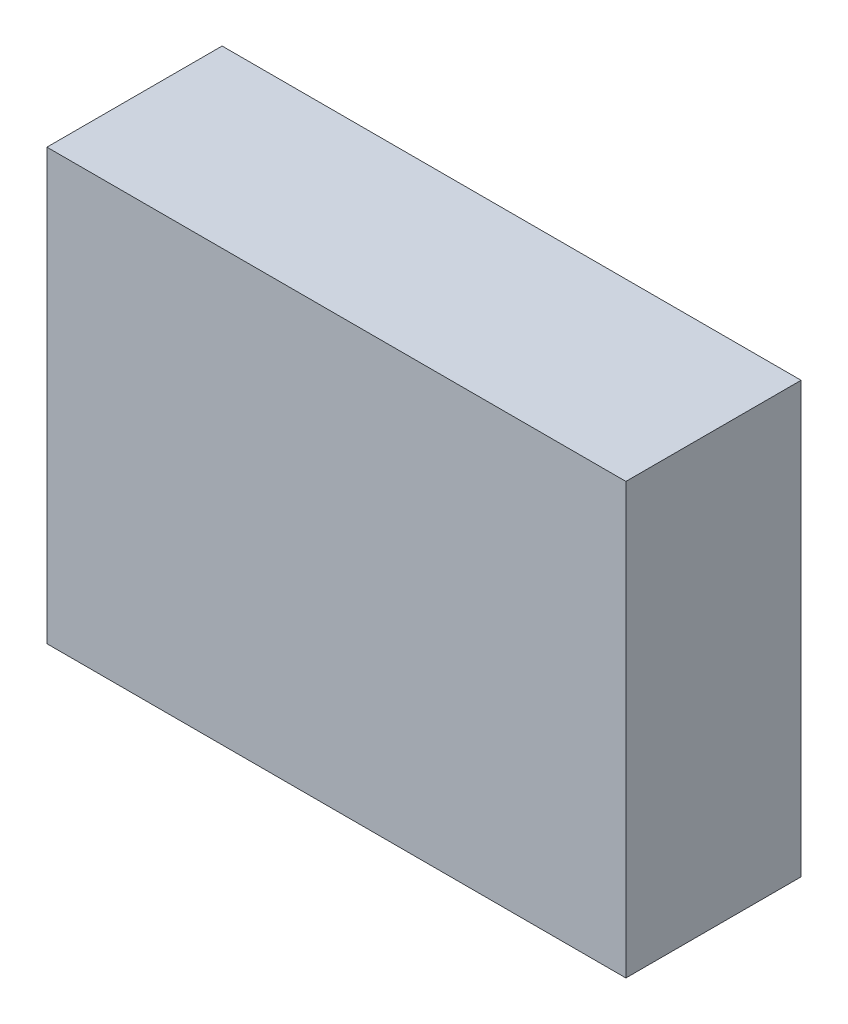
ISO-10303-21;
HEADER;
FILE_DESCRIPTION(('STEP AP214'),'2;1');
FILE_NAME('part.step','',(''),(''),'','','');
FILE_SCHEMA(('AUTOMOTIVE_DESIGN { 1 0 10303 214 1 1 1 1 }'));
ENDSEC;
DATA;
#1=APPLICATION_CONTEXT('core data for automotive mechanical design processes');
#2=APPLICATION_PROTOCOL_DEFINITION('international standard','automotive_design',2000,#1);
#3=PRODUCT_CONTEXT('',#1,'mechanical');
#4=PRODUCT('Part','Part','',(#3));
#5=PRODUCT_RELATED_PRODUCT_CATEGORY('part','',(#4));
#6=PRODUCT_DEFINITION_FORMATION('','',#4);
#7=PRODUCT_DEFINITION_CONTEXT('part definition',#1,'design');
#8=PRODUCT_DEFINITION('design','',#6,#7);
#9=PRODUCT_DEFINITION_SHAPE('','',#8);
#10=(LENGTH_UNIT() NAMED_UNIT(*) SI_UNIT(.MILLI.,.METRE.));
#11=(NAMED_UNIT(*) PLANE_ANGLE_UNIT() SI_UNIT($,.RADIAN.));
#12=(NAMED_UNIT(*) SI_UNIT($,.STERADIAN.) SOLID_ANGLE_UNIT());
#13=UNCERTAINTY_MEASURE_WITH_UNIT(LENGTH_MEASURE(1.E-05),#10,'distance_accuracy_value','');
#14=(GEOMETRIC_REPRESENTATION_CONTEXT(3) GLOBAL_UNCERTAINTY_ASSIGNED_CONTEXT((#13)) GLOBAL_UNIT_ASSIGNED_CONTEXT((#10,
#11,#12)) REPRESENTATION_CONTEXT('',''));
#15=CARTESIAN_POINT('',(0.,0.,0.));
#16=DIRECTION('',(0.,0.,1.));
#17=DIRECTION('',(1.,0.,0.));
#18=AXIS2_PLACEMENT_3D('',#15,#16,#17);
#19=CARTESIAN_POINT('',(-66.1,49.1,40.));
#20=DIRECTION('',(1.,0.,0.));
#21=DIRECTION('',(0.,1.,0.));
#22=AXIS2_PLACEMENT_3D('',#19,#20,#21);
#23=PLANE('',#22);
#24=DIRECTION('',(0.,-1.,0.));
#25=VECTOR('',#24,1.);
#26=CARTESIAN_POINT('',(-66.1,49.1,0.));
#27=LINE('',#26,#25);
#28=CARTESIAN_POINT('',(-66.1,49.1,0.));
#29=VERTEX_POINT('',#28);
#30=CARTESIAN_POINT('',(-66.1,-49.1,0.));
#31=VERTEX_POINT('',#30);
#32=EDGE_CURVE('E96',#29,#31,#27,.T.);
#33=ORIENTED_EDGE('',*,*,#32,.T.);
#34=DIRECTION('',(0.,0.,-1.));
#35=VECTOR('',#34,1.);
#36=CARTESIAN_POINT('',(-66.1,-49.1,40.));
#37=LINE('',#36,#35);
#38=CARTESIAN_POINT('',(-66.1,-49.1,40.));
#39=VERTEX_POINT('',#38);
#40=EDGE_CURVE('E11',#39,#31,#37,.T.);
#41=ORIENTED_EDGE('',*,*,#40,.F.);
#42=DIRECTION('',(0.,-1.,0.));
#43=VECTOR('',#42,1.);
#44=CARTESIAN_POINT('',(-66.1,49.1,40.));
#45=LINE('',#44,#43);
#46=CARTESIAN_POINT('',(-66.1,49.1,40.));
#47=VERTEX_POINT('',#46);
#48=EDGE_CURVE('E84',#47,#39,#45,.T.);
#49=ORIENTED_EDGE('',*,*,#48,.F.);
#50=DIRECTION('',(0.,0.,-1.));
#51=VECTOR('',#50,1.);
#52=CARTESIAN_POINT('',(-66.1,49.1,40.));
#53=LINE('',#52,#51);
#54=EDGE_CURVE('E92',#47,#29,#53,.T.);
#55=ORIENTED_EDGE('',*,*,#54,.T.);
#56=EDGE_LOOP('',(#33,#41,#49,#55));
#57=FACE_BOUND('',#56,.T.);
#58=ADVANCED_FACE('F33',(#57),#23,.F.);
#59=CARTESIAN_POINT('',(66.1,-49.1,40.));
#60=DIRECTION('',(0.,1.,0.));
#61=DIRECTION('',(-1.,0.,0.));
#62=AXIS2_PLACEMENT_3D('',#59,#60,#61);
#63=PLANE('',#62);
#64=DIRECTION('',(1.,0.,0.));
#65=VECTOR('',#64,1.);
#66=CARTESIAN_POINT('',(66.1,-49.1,0.));
#67=LINE('',#66,#65);
#68=CARTESIAN_POINT('',(66.1,-49.1,0.));
#69=VERTEX_POINT('',#68);
#70=EDGE_CURVE('E88',#31,#69,#67,.T.);
#71=ORIENTED_EDGE('',*,*,#70,.T.);
#72=DIRECTION('',(0.,0.,-1.));
#73=VECTOR('',#72,1.);
#74=CARTESIAN_POINT('',(66.1,-49.1,40.));
#75=LINE('',#74,#73);
#76=CARTESIAN_POINT('',(66.1,-49.1,40.));
#77=VERTEX_POINT('',#76);
#78=EDGE_CURVE('E41',#77,#69,#75,.T.);
#79=ORIENTED_EDGE('',*,*,#78,.F.);
#80=DIRECTION('',(1.,0.,0.));
#81=VECTOR('',#80,1.);
#82=CARTESIAN_POINT('',(66.1,-49.1,40.));
#83=LINE('',#82,#81);
#84=EDGE_CURVE('E79',#39,#77,#83,.T.);
#85=ORIENTED_EDGE('',*,*,#84,.F.);
#86=ORIENTED_EDGE('',*,*,#40,.T.);
#87=EDGE_LOOP('',(#71,#79,#85,#86));
#88=FACE_BOUND('',#87,.T.);
#89=ADVANCED_FACE('F87',(#88),#63,.F.);
#90=CARTESIAN_POINT('',(66.1,49.1,40.));
#91=DIRECTION('',(-1.,0.,0.));
#92=DIRECTION('',(0.,-1.,0.));
#93=AXIS2_PLACEMENT_3D('',#90,#91,#92);
#94=PLANE('',#93);
#95=DIRECTION('',(0.,1.,0.));
#96=VECTOR('',#95,1.);
#97=CARTESIAN_POINT('',(66.1,49.1,0.));
#98=LINE('',#97,#96);
#99=CARTESIAN_POINT('',(66.1,49.1,0.));
#100=VERTEX_POINT('',#99);
#101=EDGE_CURVE('E66',#69,#100,#98,.T.);
#102=ORIENTED_EDGE('',*,*,#101,.T.);
#103=DIRECTION('',(0.,0.,-1.));
#104=VECTOR('',#103,1.);
#105=CARTESIAN_POINT('',(66.1,49.1,40.));
#106=LINE('',#105,#104);
#107=CARTESIAN_POINT('',(66.1,49.1,40.));
#108=VERTEX_POINT('',#107);
#109=EDGE_CURVE('E89',#108,#100,#106,.T.);
#110=ORIENTED_EDGE('',*,*,#109,.F.);
#111=DIRECTION('',(0.,1.,0.));
#112=VECTOR('',#111,1.);
#113=CARTESIAN_POINT('',(66.1,49.1,40.));
#114=LINE('',#113,#112);
#115=EDGE_CURVE('E82',#77,#108,#114,.T.);
#116=ORIENTED_EDGE('',*,*,#115,.F.);
#117=ORIENTED_EDGE('',*,*,#78,.T.);
#118=EDGE_LOOP('',(#102,#110,#116,#117));
#119=FACE_BOUND('',#118,.T.);
#120=ADVANCED_FACE('F90',(#119),#94,.F.);
#121=CARTESIAN_POINT('',(66.1,49.1,40.));
#122=DIRECTION('',(0.,-1.,0.));
#123=DIRECTION('',(1.,0.,0.));
#124=AXIS2_PLACEMENT_3D('',#121,#122,#123);
#125=PLANE('',#124);
#126=DIRECTION('',(-1.,0.,0.));
#127=VECTOR('',#126,1.);
#128=CARTESIAN_POINT('',(66.1,49.1,0.));
#129=LINE('',#128,#127);
#130=EDGE_CURVE('E72',#100,#29,#129,.T.);
#131=ORIENTED_EDGE('',*,*,#130,.T.);
#132=ORIENTED_EDGE('',*,*,#54,.F.);
#133=DIRECTION('',(-1.,0.,0.));
#134=VECTOR('',#133,1.);
#135=CARTESIAN_POINT('',(66.1,49.1,40.));
#136=LINE('',#135,#134);
#137=EDGE_CURVE('E49',#108,#47,#136,.T.);
#138=ORIENTED_EDGE('',*,*,#137,.F.);
#139=ORIENTED_EDGE('',*,*,#109,.T.);
#140=EDGE_LOOP('',(#131,#132,#138,#139));
#141=FACE_BOUND('',#140,.T.);
#142=ADVANCED_FACE('F103',(#141),#125,.F.);
#143=CARTESIAN_POINT('',(0.,0.,40.));
#144=DIRECTION('',(0.,0.,-1.));
#145=DIRECTION('',(-1.,0.,0.));
#146=AXIS2_PLACEMENT_3D('',#143,#144,#145);
#147=PLANE('',#146);
#148=ORIENTED_EDGE('',*,*,#48,.T.);
#149=ORIENTED_EDGE('',*,*,#84,.T.);
#150=ORIENTED_EDGE('',*,*,#115,.T.);
#151=ORIENTED_EDGE('',*,*,#137,.T.);
#152=EDGE_LOOP('',(#148,#149,#150,#151));
#153=FACE_BOUND('',#152,.T.);
#154=ADVANCED_FACE('F80',(#153),#147,.F.);
#155=CARTESIAN_POINT('',(0.,0.,0.));
#156=DIRECTION('',(0.,0.,-1.));
#157=DIRECTION('',(-1.,0.,0.));
#158=AXIS2_PLACEMENT_3D('',#155,#156,#157);
#159=PLANE('',#158);
#160=ORIENTED_EDGE('',*,*,#32,.F.);
#161=ORIENTED_EDGE('',*,*,#130,.F.);
#162=ORIENTED_EDGE('',*,*,#101,.F.);
#163=ORIENTED_EDGE('',*,*,#70,.F.);
#164=EDGE_LOOP('',(#160,#161,#162,#163));
#165=FACE_BOUND('',#164,.T.);
#166=ADVANCED_FACE('F106',(#165),#159,.T.);
#167=CLOSED_SHELL('',(#58,#89,#120,#142,#154,#166));
#168=MANIFOLD_SOLID_BREP('B2',#167);
#169=ADVANCED_BREP_SHAPE_REPRESENTATION('',(#18,#168),#14);
#170=SHAPE_DEFINITION_REPRESENTATION(#9,#169);
ENDSEC;
END-ISO-10303-21;
